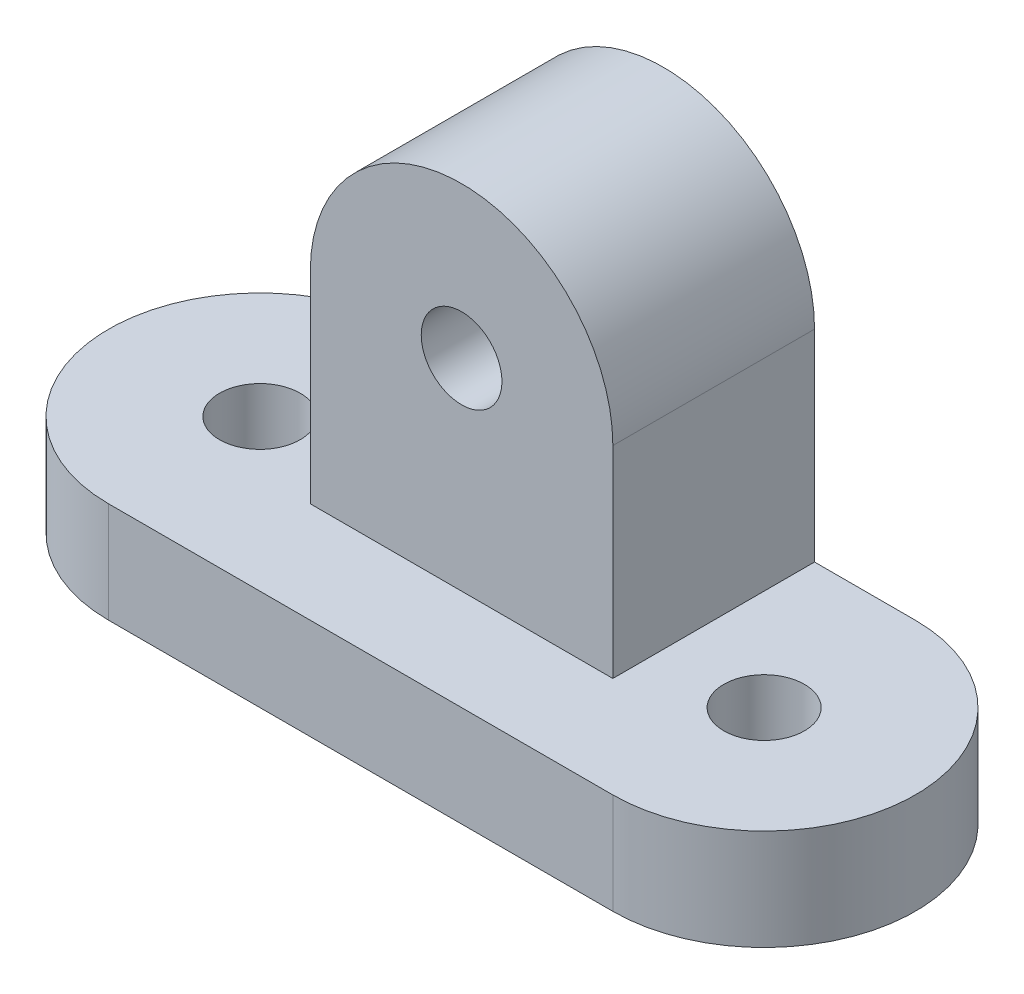
ISO-10303-21;
HEADER;
FILE_DESCRIPTION(('STEP AP214'),'2;1');
FILE_NAME('part.step','',(''),(''),'','','');
FILE_SCHEMA(('AUTOMOTIVE_DESIGN { 1 0 10303 214 1 1 1 1 }'));
ENDSEC;
DATA;
#1=APPLICATION_CONTEXT('core data for automotive mechanical design processes');
#2=APPLICATION_PROTOCOL_DEFINITION('international standard','automotive_design',2000,#1);
#3=PRODUCT_CONTEXT('',#1,'mechanical');
#4=PRODUCT('Part','Part','',(#3));
#5=PRODUCT_RELATED_PRODUCT_CATEGORY('part','',(#4));
#6=PRODUCT_DEFINITION_FORMATION('','',#4);
#7=PRODUCT_DEFINITION_CONTEXT('part definition',#1,'design');
#8=PRODUCT_DEFINITION('design','',#6,#7);
#9=PRODUCT_DEFINITION_SHAPE('','',#8);
#10=(LENGTH_UNIT() NAMED_UNIT(*) SI_UNIT(.MILLI.,.METRE.));
#11=(NAMED_UNIT(*) PLANE_ANGLE_UNIT() SI_UNIT($,.RADIAN.));
#12=(NAMED_UNIT(*) SI_UNIT($,.STERADIAN.) SOLID_ANGLE_UNIT());
#13=UNCERTAINTY_MEASURE_WITH_UNIT(LENGTH_MEASURE(1.E-05),#10,'distance_accuracy_value','');
#14=(GEOMETRIC_REPRESENTATION_CONTEXT(3) GLOBAL_UNCERTAINTY_ASSIGNED_CONTEXT((#13)) GLOBAL_UNIT_ASSIGNED_CONTEXT((#10,
#11,#12)) REPRESENTATION_CONTEXT('',''));
#15=CARTESIAN_POINT('',(0.,0.,0.));
#16=DIRECTION('',(0.,0.,1.));
#17=DIRECTION('',(1.,0.,0.));
#18=AXIS2_PLACEMENT_3D('',#15,#16,#17);
#19=CARTESIAN_POINT('',(0.,5.,-7.5));
#20=DIRECTION('',(0.,1.,0.));
#21=DIRECTION('',(0.,0.,1.));
#22=AXIS2_PLACEMENT_3D('',#19,#20,#21);
#23=PLANE('',#22);
#24=DIRECTION('',(0.,0.,-1.));
#25=VECTOR('',#24,1.);
#26=CARTESIAN_POINT('',(20.,5.,-5.));
#27=LINE('',#26,#25);
#28=CARTESIAN_POINT('',(20.,5.,-5.));
#29=VERTEX_POINT('',#28);
#30=CARTESIAN_POINT('',(20.,5.,-15.));
#31=VERTEX_POINT('',#30);
#32=EDGE_CURVE('E120',#29,#31,#27,.T.);
#33=ORIENTED_EDGE('',*,*,#32,.F.);
#34=DIRECTION('',(-1.,0.,0.));
#35=VECTOR('',#34,1.);
#36=CARTESIAN_POINT('',(20.,5.,-5.));
#37=LINE('',#36,#35);
#38=CARTESIAN_POINT('',(4.99999999999999,5.,-5.));
#39=VERTEX_POINT('',#38);
#40=EDGE_CURVE('E107',#29,#39,#37,.T.);
#41=ORIENTED_EDGE('',*,*,#40,.T.);
#42=DIRECTION('',(0.,0.,-1.));
#43=VECTOR('',#42,1.);
#44=CARTESIAN_POINT('',(4.99999999999999,5.,-5.));
#45=LINE('',#44,#43);
#46=CARTESIAN_POINT('',(4.99999999999999,5.,-15.));
#47=VERTEX_POINT('',#46);
#48=EDGE_CURVE('E129',#39,#47,#45,.T.);
#49=ORIENTED_EDGE('',*,*,#48,.T.);
#50=DIRECTION('',(-1.,0.,0.));
#51=VECTOR('',#50,1.);
#52=CARTESIAN_POINT('',(0.,5.,-15.));
#53=LINE('',#52,#51);
#54=CARTESIAN_POINT('',(0.,5.,-15.));
#55=VERTEX_POINT('',#54);
#56=EDGE_CURVE('E55',#47,#55,#53,.T.);
#57=ORIENTED_EDGE('',*,*,#56,.T.);
#58=CARTESIAN_POINT('',(0.,5.,-7.5));
#59=DIRECTION('',(0.,1.,0.));
#60=DIRECTION('',(0.,0.,1.));
#61=AXIS2_PLACEMENT_3D('',#58,#59,#60);
#62=CIRCLE('',#61,7.5);
#63=CARTESIAN_POINT('',(0.,5.,0.));
#64=VERTEX_POINT('',#63);
#65=EDGE_CURVE('E150',#55,#64,#62,.T.);
#66=ORIENTED_EDGE('',*,*,#65,.T.);
#67=DIRECTION('',(1.,0.,0.));
#68=VECTOR('',#67,1.);
#69=CARTESIAN_POINT('',(0.,5.,0.));
#70=LINE('',#69,#68);
#71=CARTESIAN_POINT('',(25.,5.,0.));
#72=VERTEX_POINT('',#71);
#73=EDGE_CURVE('E84',#64,#72,#70,.T.);
#74=ORIENTED_EDGE('',*,*,#73,.T.);
#75=CARTESIAN_POINT('',(25.,5.,-7.5));
#76=DIRECTION('',(0.,1.,0.));
#77=DIRECTION('',(0.,0.,-1.));
#78=AXIS2_PLACEMENT_3D('',#75,#76,#77);
#79=CIRCLE('',#78,7.5);
#80=CARTESIAN_POINT('',(25.,5.,-15.));
#81=VERTEX_POINT('',#80);
#82=EDGE_CURVE('E153',#72,#81,#79,.T.);
#83=ORIENTED_EDGE('',*,*,#82,.T.);
#84=EDGE_CURVE('E128',#81,#31,#53,.T.);
#85=ORIENTED_EDGE('',*,*,#84,.T.);
#86=EDGE_LOOP('',(#33,#41,#49,#57,#66,#74,#83,#85));
#87=FACE_BOUND('',#86,.T.);
#88=CARTESIAN_POINT('',(0.,5.,-7.5));
#89=DIRECTION('',(0.,1.,0.));
#90=DIRECTION('',(0.,0.,1.));
#91=AXIS2_PLACEMENT_3D('',#88,#89,#90);
#92=CIRCLE('',#91,2.);
#93=CARTESIAN_POINT('',(0.,5.,-5.5));
#94=VERTEX_POINT('',#93);
#95=EDGE_CURVE('E144',#94,#94,#92,.T.);
#96=ORIENTED_EDGE('',*,*,#95,.F.);
#97=EDGE_LOOP('',(#96));
#98=FACE_BOUND('',#97,.T.);
#99=CARTESIAN_POINT('',(25.,5.,-7.5));
#100=DIRECTION('',(0.,1.,0.));
#101=DIRECTION('',(0.,0.,1.));
#102=AXIS2_PLACEMENT_3D('',#99,#100,#101);
#103=CIRCLE('',#102,2.);
#104=CARTESIAN_POINT('',(25.,5.,-5.5));
#105=VERTEX_POINT('',#104);
#106=EDGE_CURVE('E137',#105,#105,#103,.T.);
#107=ORIENTED_EDGE('',*,*,#106,.F.);
#108=EDGE_LOOP('',(#107));
#109=FACE_BOUND('',#108,.T.);
#110=ADVANCED_FACE('F32',(#87,#98,#109),#23,.T.);
#111=CARTESIAN_POINT('',(0.,0.,-7.5));
#112=DIRECTION('',(0.,1.,0.));
#113=DIRECTION('',(0.,0.,1.));
#114=AXIS2_PLACEMENT_3D('',#111,#112,#113);
#115=PLANE('',#114);
#116=CARTESIAN_POINT('',(0.,0.,-7.5));
#117=DIRECTION('',(0.,1.,0.));
#118=DIRECTION('',(0.,0.,1.));
#119=AXIS2_PLACEMENT_3D('',#116,#117,#118);
#120=CIRCLE('',#119,7.5);
#121=CARTESIAN_POINT('',(0.,0.,-15.));
#122=VERTEX_POINT('',#121);
#123=CARTESIAN_POINT('',(0.,0.,0.));
#124=VERTEX_POINT('',#123);
#125=EDGE_CURVE('E147',#122,#124,#120,.T.);
#126=ORIENTED_EDGE('',*,*,#125,.F.);
#127=DIRECTION('',(-1.,0.,0.));
#128=VECTOR('',#127,1.);
#129=CARTESIAN_POINT('',(0.,0.,-15.));
#130=LINE('',#129,#128);
#131=CARTESIAN_POINT('',(25.,0.,-15.));
#132=VERTEX_POINT('',#131);
#133=EDGE_CURVE('E77',#132,#122,#130,.T.);
#134=ORIENTED_EDGE('',*,*,#133,.F.);
#135=CARTESIAN_POINT('',(25.,0.,-7.5));
#136=DIRECTION('',(0.,1.,0.));
#137=DIRECTION('',(0.,0.,-1.));
#138=AXIS2_PLACEMENT_3D('',#135,#136,#137);
#139=CIRCLE('',#138,7.5);
#140=CARTESIAN_POINT('',(25.,0.,0.));
#141=VERTEX_POINT('',#140);
#142=EDGE_CURVE('E161',#141,#132,#139,.T.);
#143=ORIENTED_EDGE('',*,*,#142,.F.);
#144=DIRECTION('',(1.,0.,0.));
#145=VECTOR('',#144,1.);
#146=CARTESIAN_POINT('',(0.,0.,0.));
#147=LINE('',#146,#145);
#148=EDGE_CURVE('E159',#124,#141,#147,.T.);
#149=ORIENTED_EDGE('',*,*,#148,.F.);
#150=EDGE_LOOP('',(#126,#134,#143,#149));
#151=FACE_BOUND('',#150,.T.);
#152=CARTESIAN_POINT('',(0.,0.,-7.5));
#153=DIRECTION('',(0.,1.,0.));
#154=DIRECTION('',(0.,0.,1.));
#155=AXIS2_PLACEMENT_3D('',#152,#153,#154);
#156=CIRCLE('',#155,2.);
#157=CARTESIAN_POINT('',(0.,0.,-5.5));
#158=VERTEX_POINT('',#157);
#159=EDGE_CURVE('E140',#158,#158,#156,.T.);
#160=ORIENTED_EDGE('',*,*,#159,.T.);
#161=EDGE_LOOP('',(#160));
#162=FACE_BOUND('',#161,.T.);
#163=CARTESIAN_POINT('',(25.,0.,-7.5));
#164=DIRECTION('',(0.,1.,0.));
#165=DIRECTION('',(0.,0.,1.));
#166=AXIS2_PLACEMENT_3D('',#163,#164,#165);
#167=CIRCLE('',#166,2.);
#168=CARTESIAN_POINT('',(25.,0.,-5.5));
#169=VERTEX_POINT('',#168);
#170=EDGE_CURVE('E141',#169,#169,#167,.T.);
#171=ORIENTED_EDGE('',*,*,#170,.T.);
#172=EDGE_LOOP('',(#171));
#173=FACE_BOUND('',#172,.T.);
#174=ADVANCED_FACE('F174',(#151,#162,#173),#115,.F.);
#175=CARTESIAN_POINT('',(0.,5.,-7.5));
#176=DIRECTION('',(0.,-1.,0.));
#177=DIRECTION('',(0.,0.,-1.));
#178=AXIS2_PLACEMENT_3D('',#175,#176,#177);
#179=CYLINDRICAL_SURFACE('',#178,7.5);
#180=ORIENTED_EDGE('',*,*,#125,.T.);
#181=DIRECTION('',(0.,-1.,0.));
#182=VECTOR('',#181,1.);
#183=CARTESIAN_POINT('',(0.,5.,0.));
#184=LINE('',#183,#182);
#185=EDGE_CURVE('E11',#64,#124,#184,.T.);
#186=ORIENTED_EDGE('',*,*,#185,.F.);
#187=ORIENTED_EDGE('',*,*,#65,.F.);
#188=DIRECTION('',(0.,-1.,0.));
#189=VECTOR('',#188,1.);
#190=CARTESIAN_POINT('',(0.,5.,-15.));
#191=LINE('',#190,#189);
#192=EDGE_CURVE('E156',#55,#122,#191,.T.);
#193=ORIENTED_EDGE('',*,*,#192,.T.);
#194=EDGE_LOOP('',(#180,#186,#187,#193));
#195=FACE_BOUND('',#194,.T.);
#196=ADVANCED_FACE('F34',(#195),#179,.T.);
#197=CARTESIAN_POINT('',(0.,5.,0.));
#198=DIRECTION('',(0.,0.,-1.));
#199=DIRECTION('',(-1.,0.,0.));
#200=AXIS2_PLACEMENT_3D('',#197,#198,#199);
#201=PLANE('',#200);
#202=ORIENTED_EDGE('',*,*,#148,.T.);
#203=DIRECTION('',(0.,-1.,0.));
#204=VECTOR('',#203,1.);
#205=CARTESIAN_POINT('',(25.,5.,0.));
#206=LINE('',#205,#204);
#207=EDGE_CURVE('E40',#72,#141,#206,.T.);
#208=ORIENTED_EDGE('',*,*,#207,.F.);
#209=ORIENTED_EDGE('',*,*,#73,.F.);
#210=ORIENTED_EDGE('',*,*,#185,.T.);
#211=EDGE_LOOP('',(#202,#208,#209,#210));
#212=FACE_BOUND('',#211,.T.);
#213=ADVANCED_FACE('F213',(#212),#201,.F.);
#214=CARTESIAN_POINT('',(25.,5.,-7.5));
#215=DIRECTION('',(0.,-1.,0.));
#216=DIRECTION('',(0.,0.,-1.));
#217=AXIS2_PLACEMENT_3D('',#214,#215,#216);
#218=CYLINDRICAL_SURFACE('',#217,7.5);
#219=ORIENTED_EDGE('',*,*,#142,.T.);
#220=DIRECTION('',(0.,-1.,0.));
#221=VECTOR('',#220,1.);
#222=CARTESIAN_POINT('',(25.,5.,-15.));
#223=LINE('',#222,#221);
#224=EDGE_CURVE('E165',#81,#132,#223,.T.);
#225=ORIENTED_EDGE('',*,*,#224,.F.);
#226=ORIENTED_EDGE('',*,*,#82,.F.);
#227=ORIENTED_EDGE('',*,*,#207,.T.);
#228=EDGE_LOOP('',(#219,#225,#226,#227));
#229=FACE_BOUND('',#228,.T.);
#230=ADVANCED_FACE('F170',(#229),#218,.T.);
#231=CARTESIAN_POINT('',(0.,5.,-15.));
#232=DIRECTION('',(0.,0.,1.));
#233=DIRECTION('',(1.,0.,0.));
#234=AXIS2_PLACEMENT_3D('',#231,#232,#233);
#235=PLANE('',#234);
#236=ORIENTED_EDGE('',*,*,#133,.T.);
#237=ORIENTED_EDGE('',*,*,#192,.F.);
#238=ORIENTED_EDGE('',*,*,#56,.F.);
#239=DIRECTION('',(0.,1.,0.));
#240=VECTOR('',#239,1.);
#241=CARTESIAN_POINT('',(4.99999999999999,5.,-15.));
#242=LINE('',#241,#240);
#243=CARTESIAN_POINT('',(5.,15.,-15.));
#244=VERTEX_POINT('',#243);
#245=EDGE_CURVE('E47',#47,#244,#242,.T.);
#246=ORIENTED_EDGE('',*,*,#245,.T.);
#247=CARTESIAN_POINT('',(12.5,15.,-15.));
#248=DIRECTION('',(0.,0.,-1.));
#249=DIRECTION('',(1.,0.,0.));
#250=AXIS2_PLACEMENT_3D('',#247,#248,#249);
#251=CIRCLE('',#250,7.5);
#252=CARTESIAN_POINT('',(20.,15.,-15.));
#253=VERTEX_POINT('',#252);
#254=EDGE_CURVE('E123',#244,#253,#251,.T.);
#255=ORIENTED_EDGE('',*,*,#254,.T.);
#256=DIRECTION('',(0.,-1.,0.));
#257=VECTOR('',#256,1.);
#258=CARTESIAN_POINT('',(20.,5.,-15.));
#259=LINE('',#258,#257);
#260=EDGE_CURVE('E183',#253,#31,#259,.T.);
#261=ORIENTED_EDGE('',*,*,#260,.T.);
#262=ORIENTED_EDGE('',*,*,#84,.F.);
#263=ORIENTED_EDGE('',*,*,#224,.T.);
#264=EDGE_LOOP('',(#236,#237,#238,#246,#255,#261,#262,#263));
#265=FACE_BOUND('',#264,.T.);
#266=CARTESIAN_POINT('',(12.5,15.,-15.));
#267=DIRECTION('',(0.,0.,-1.));
#268=DIRECTION('',(-1.,0.,0.));
#269=AXIS2_PLACEMENT_3D('',#266,#267,#268);
#270=CIRCLE('',#269,2.00000000000001);
#271=CARTESIAN_POINT('',(10.5,15.,-15.));
#272=VERTEX_POINT('',#271);
#273=EDGE_CURVE('E194',#272,#272,#270,.T.);
#274=ORIENTED_EDGE('',*,*,#273,.F.);
#275=EDGE_LOOP('',(#274));
#276=FACE_BOUND('',#275,.T.);
#277=ADVANCED_FACE('F179',(#265,#276),#235,.F.);
#278=CARTESIAN_POINT('',(0.,5.,-7.5));
#279=DIRECTION('',(0.,-1.,0.));
#280=DIRECTION('',(0.,0.,-1.));
#281=AXIS2_PLACEMENT_3D('',#278,#279,#280);
#282=CYLINDRICAL_SURFACE('',#281,2.);
#283=ORIENTED_EDGE('',*,*,#95,.T.);
#284=EDGE_LOOP('',(#283));
#285=FACE_BOUND('',#284,.T.);
#286=ORIENTED_EDGE('',*,*,#159,.F.);
#287=EDGE_LOOP('',(#286));
#288=FACE_BOUND('',#287,.T.);
#289=ADVANCED_FACE('F204',(#285,#288),#282,.F.);
#290=CARTESIAN_POINT('',(25.,5.,-7.5));
#291=DIRECTION('',(0.,-1.,0.));
#292=DIRECTION('',(0.,0.,-1.));
#293=AXIS2_PLACEMENT_3D('',#290,#291,#292);
#294=CYLINDRICAL_SURFACE('',#293,2.);
#295=ORIENTED_EDGE('',*,*,#106,.T.);
#296=EDGE_LOOP('',(#295));
#297=FACE_BOUND('',#296,.T.);
#298=ORIENTED_EDGE('',*,*,#170,.F.);
#299=EDGE_LOOP('',(#298));
#300=FACE_BOUND('',#299,.T.);
#301=ADVANCED_FACE('F210',(#297,#300),#294,.F.);
#302=CARTESIAN_POINT('',(20.,5.,-5.));
#303=DIRECTION('',(1.,0.,0.));
#304=DIRECTION('',(0.,0.,-1.));
#305=AXIS2_PLACEMENT_3D('',#302,#303,#304);
#306=PLANE('',#305);
#307=ORIENTED_EDGE('',*,*,#260,.F.);
#308=DIRECTION('',(0.,0.,-1.));
#309=VECTOR('',#308,1.);
#310=CARTESIAN_POINT('',(20.,15.,-5.));
#311=LINE('',#310,#309);
#312=CARTESIAN_POINT('',(20.,15.,-5.));
#313=VERTEX_POINT('',#312);
#314=EDGE_CURVE('E122',#313,#253,#311,.T.);
#315=ORIENTED_EDGE('',*,*,#314,.F.);
#316=DIRECTION('',(0.,-1.,0.));
#317=VECTOR('',#316,1.);
#318=CARTESIAN_POINT('',(20.,5.,-5.));
#319=LINE('',#318,#317);
#320=EDGE_CURVE('E111',#313,#29,#319,.T.);
#321=ORIENTED_EDGE('',*,*,#320,.T.);
#322=ORIENTED_EDGE('',*,*,#32,.T.);
#323=EDGE_LOOP('',(#307,#315,#321,#322));
#324=FACE_BOUND('',#323,.T.);
#325=ADVANCED_FACE('F119',(#324),#306,.T.);
#326=CARTESIAN_POINT('',(12.5,15.,-5.));
#327=DIRECTION('',(0.,0.,-1.));
#328=DIRECTION('',(-1.,0.,0.));
#329=AXIS2_PLACEMENT_3D('',#326,#327,#328);
#330=CYLINDRICAL_SURFACE('',#329,7.5);
#331=ORIENTED_EDGE('',*,*,#254,.F.);
#332=DIRECTION('',(0.,0.,-1.));
#333=VECTOR('',#332,1.);
#334=CARTESIAN_POINT('',(5.,15.,-5.));
#335=LINE('',#334,#333);
#336=CARTESIAN_POINT('',(5.,15.,-5.));
#337=VERTEX_POINT('',#336);
#338=EDGE_CURVE('E132',#337,#244,#335,.T.);
#339=ORIENTED_EDGE('',*,*,#338,.F.);
#340=CARTESIAN_POINT('',(12.5,15.,-5.));
#341=DIRECTION('',(0.,0.,-1.));
#342=DIRECTION('',(1.,0.,0.));
#343=AXIS2_PLACEMENT_3D('',#340,#341,#342);
#344=CIRCLE('',#343,7.5);
#345=EDGE_CURVE('E130',#337,#313,#344,.T.);
#346=ORIENTED_EDGE('',*,*,#345,.T.);
#347=ORIENTED_EDGE('',*,*,#314,.T.);
#348=EDGE_LOOP('',(#331,#339,#346,#347));
#349=FACE_BOUND('',#348,.T.);
#350=ADVANCED_FACE('F186',(#349),#330,.T.);
#351=CARTESIAN_POINT('',(4.99999999999999,5.,-5.));
#352=DIRECTION('',(-1.,0.,0.));
#353=DIRECTION('',(0.,-1.,0.));
#354=AXIS2_PLACEMENT_3D('',#351,#352,#353);
#355=PLANE('',#354);
#356=ORIENTED_EDGE('',*,*,#245,.F.);
#357=ORIENTED_EDGE('',*,*,#48,.F.);
#358=DIRECTION('',(0.,1.,0.));
#359=VECTOR('',#358,1.);
#360=CARTESIAN_POINT('',(4.99999999999999,5.,-5.));
#361=LINE('',#360,#359);
#362=EDGE_CURVE('E114',#39,#337,#361,.T.);
#363=ORIENTED_EDGE('',*,*,#362,.T.);
#364=ORIENTED_EDGE('',*,*,#338,.T.);
#365=EDGE_LOOP('',(#356,#357,#363,#364));
#366=FACE_BOUND('',#365,.T.);
#367=ADVANCED_FACE('F190',(#366),#355,.T.);
#368=CARTESIAN_POINT('',(12.5,15.,-5.));
#369=DIRECTION('',(0.,0.,1.));
#370=DIRECTION('',(1.,0.,0.));
#371=AXIS2_PLACEMENT_3D('',#368,#369,#370);
#372=PLANE('',#371);
#373=CARTESIAN_POINT('',(12.5,15.,-5.));
#374=DIRECTION('',(0.,0.,-1.));
#375=DIRECTION('',(-1.,0.,0.));
#376=AXIS2_PLACEMENT_3D('',#373,#374,#375);
#377=CIRCLE('',#376,2.00000000000001);
#378=CARTESIAN_POINT('',(10.5,15.,-5.));
#379=VERTEX_POINT('',#378);
#380=EDGE_CURVE('E192',#379,#379,#377,.T.);
#381=ORIENTED_EDGE('',*,*,#380,.T.);
#382=EDGE_LOOP('',(#381));
#383=FACE_BOUND('',#382,.T.);
#384=ORIENTED_EDGE('',*,*,#320,.F.);
#385=ORIENTED_EDGE('',*,*,#345,.F.);
#386=ORIENTED_EDGE('',*,*,#362,.F.);
#387=ORIENTED_EDGE('',*,*,#40,.F.);
#388=EDGE_LOOP('',(#384,#385,#386,#387));
#389=FACE_BOUND('',#388,.T.);
#390=ADVANCED_FACE('F109',(#383,#389),#372,.T.);
#391=CARTESIAN_POINT('',(12.5,15.,-5.));
#392=DIRECTION('',(0.,0.,-1.));
#393=DIRECTION('',(-1.,0.,0.));
#394=AXIS2_PLACEMENT_3D('',#391,#392,#393);
#395=CYLINDRICAL_SURFACE('',#394,2.00000000000001);
#396=ORIENTED_EDGE('',*,*,#380,.F.);
#397=EDGE_LOOP('',(#396));
#398=FACE_BOUND('',#397,.T.);
#399=ORIENTED_EDGE('',*,*,#273,.T.);
#400=EDGE_LOOP('',(#399));
#401=FACE_BOUND('',#400,.T.);
#402=ADVANCED_FACE('F202',(#398,#401),#395,.F.);
#403=CLOSED_SHELL('',(#110,#174,#196,#213,#230,#277,#289,#301,#325,#350,#367,#390,#402));
#404=MANIFOLD_SOLID_BREP('B2',#403);
#405=ADVANCED_BREP_SHAPE_REPRESENTATION('',(#18,#404),#14);
#406=SHAPE_DEFINITION_REPRESENTATION(#9,#405);
ENDSEC;
END-ISO-10303-21;
